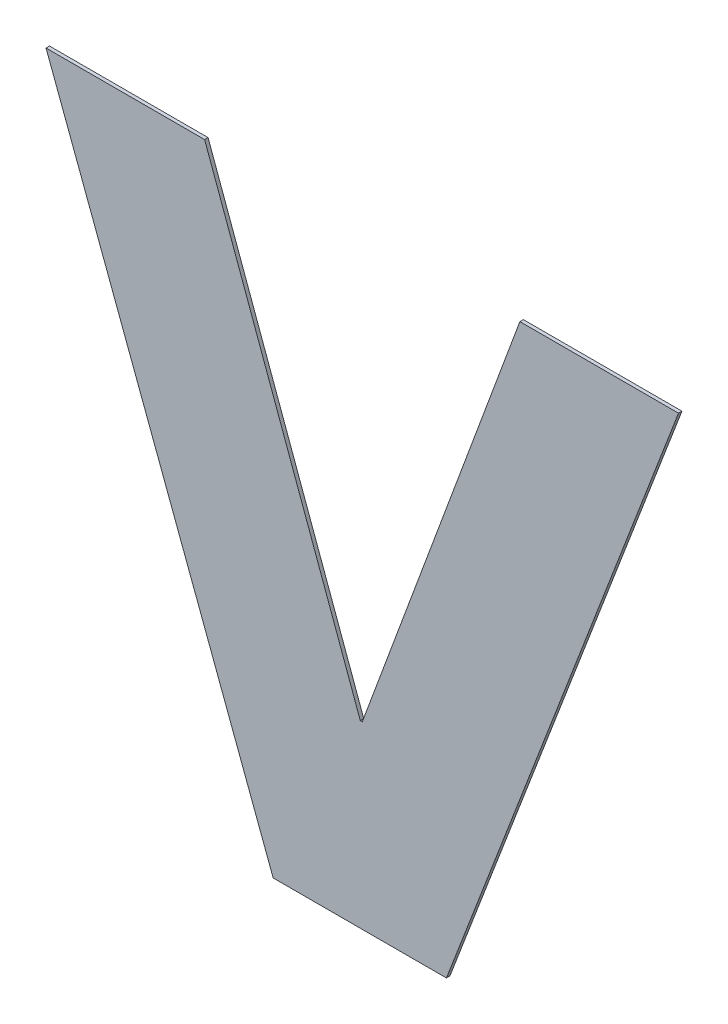
ISO-10303-21;
HEADER;
FILE_DESCRIPTION(('STEP AP214'),'2;1');
FILE_NAME('part.step','',(''),(''),'','','');
FILE_SCHEMA(('AUTOMOTIVE_DESIGN { 1 0 10303 214 1 1 1 1 }'));
ENDSEC;
DATA;
#1=APPLICATION_CONTEXT('core data for automotive mechanical design processes');
#2=APPLICATION_PROTOCOL_DEFINITION('international standard','automotive_design',2000,#1);
#3=PRODUCT_CONTEXT('',#1,'mechanical');
#4=PRODUCT('Part','Part','',(#3));
#5=PRODUCT_RELATED_PRODUCT_CATEGORY('part','',(#4));
#6=PRODUCT_DEFINITION_FORMATION('','',#4);
#7=PRODUCT_DEFINITION_CONTEXT('part definition',#1,'design');
#8=PRODUCT_DEFINITION('design','',#6,#7);
#9=PRODUCT_DEFINITION_SHAPE('','',#8);
#10=(LENGTH_UNIT() NAMED_UNIT(*) SI_UNIT(.MILLI.,.METRE.));
#11=(NAMED_UNIT(*) PLANE_ANGLE_UNIT() SI_UNIT($,.RADIAN.));
#12=(NAMED_UNIT(*) SI_UNIT($,.STERADIAN.) SOLID_ANGLE_UNIT());
#13=UNCERTAINTY_MEASURE_WITH_UNIT(LENGTH_MEASURE(1.E-05),#10,'distance_accuracy_value','');
#14=(GEOMETRIC_REPRESENTATION_CONTEXT(3) GLOBAL_UNCERTAINTY_ASSIGNED_CONTEXT((#13)) GLOBAL_UNIT_ASSIGNED_CONTEXT((#10,
#11,#12)) REPRESENTATION_CONTEXT('',''));
#15=CARTESIAN_POINT('',(0.,0.,0.));
#16=DIRECTION('',(0.,0.,1.));
#17=DIRECTION('',(1.,0.,0.));
#18=AXIS2_PLACEMENT_3D('',#15,#16,#17);
#19=CARTESIAN_POINT('',(-0.220778655224025,0.77328037838195,0.00045));
#20=DIRECTION('',(0.,-1.,0.));
#21=DIRECTION('',(0.,0.,-1.));
#22=AXIS2_PLACEMENT_3D('',#19,#20,#21);
#23=PLANE('',#22);
#24=DIRECTION('',(0.,0.,1.));
#25=VECTOR('',#24,1.);
#26=CARTESIAN_POINT('',(-0.209498829549,0.77328037838195,0.));
#27=LINE('',#26,#25);
#28=CARTESIAN_POINT('',(-0.209498829549,0.77328037838195,0.));
#29=VERTEX_POINT('',#28);
#30=CARTESIAN_POINT('',(-0.209498829549,0.77328037838195,0.00045));
#31=VERTEX_POINT('',#30);
#32=EDGE_CURVE('E11',#29,#31,#27,.T.);
#33=ORIENTED_EDGE('',*,*,#32,.T.);
#34=DIRECTION('',(-1.,0.,0.));
#35=VECTOR('',#34,1.);
#36=CARTESIAN_POINT('',(-0.209498829549,0.77328037838195,0.00045));
#37=LINE('',#36,#35);
#38=CARTESIAN_POINT('',(-0.23205848089905,0.77328037838195,0.00045));
#39=VERTEX_POINT('',#38);
#40=EDGE_CURVE('E143',#31,#39,#37,.T.);
#41=ORIENTED_EDGE('',*,*,#40,.T.);
#42=DIRECTION('',(0.,0.,1.));
#43=VECTOR('',#42,1.);
#44=CARTESIAN_POINT('',(-0.23205848089905,0.77328037838195,0.));
#45=LINE('',#44,#43);
#46=CARTESIAN_POINT('',(-0.23205848089905,0.77328037838195,0.));
#47=VERTEX_POINT('',#46);
#48=EDGE_CURVE('E24',#47,#39,#45,.T.);
#49=ORIENTED_EDGE('',*,*,#48,.F.);
#50=DIRECTION('',(-1.,0.,0.));
#51=VECTOR('',#50,1.);
#52=CARTESIAN_POINT('',(-0.209498829549,0.77328037838195,0.));
#53=LINE('',#52,#51);
#54=EDGE_CURVE('E132',#29,#47,#53,.T.);
#55=ORIENTED_EDGE('',*,*,#54,.F.);
#56=EDGE_LOOP('',(#33,#41,#49,#55));
#57=FACE_BOUND('',#56,.T.);
#58=ADVANCED_FACE('F17',(#57),#23,.T.);
#59=CARTESIAN_POINT('',(-0.246843954249,0.8126754605645,0.00045));
#60=DIRECTION('',(-0.936232902766256,-0.351380067416851,0.));
#61=DIRECTION('',(0.,0.,1.));
#62=AXIS2_PLACEMENT_3D('',#59,#60,#61);
#63=PLANE('',#62);
#64=ORIENTED_EDGE('',*,*,#48,.T.);
#65=DIRECTION('',(-0.351380067416851,0.936232902766256,0.));
#66=VECTOR('',#65,1.);
#67=CARTESIAN_POINT('',(-0.23205848089905,0.77328037838195,0.00045));
#68=LINE('',#67,#66);
#69=CARTESIAN_POINT('',(-0.26162942759895,0.85207054274705,0.00045));
#70=VERTEX_POINT('',#69);
#71=EDGE_CURVE('E139',#39,#70,#68,.T.);
#72=ORIENTED_EDGE('',*,*,#71,.T.);
#73=DIRECTION('',(-1.2335811384724E-13,0.,1.));
#74=VECTOR('',#73,1.);
#75=CARTESIAN_POINT('',(-0.26162942759895,0.85207054274705,0.));
#76=LINE('',#75,#74);
#77=CARTESIAN_POINT('',(-0.26162942759895,0.85207054274705,0.));
#78=VERTEX_POINT('',#77);
#79=EDGE_CURVE('E141',#78,#70,#76,.T.);
#80=ORIENTED_EDGE('',*,*,#79,.F.);
#81=DIRECTION('',(-0.351380067416851,0.936232902766256,0.));
#82=VECTOR('',#81,1.);
#83=CARTESIAN_POINT('',(-0.23205848089905,0.77328037838195,0.));
#84=LINE('',#83,#82);
#85=EDGE_CURVE('E124',#47,#78,#84,.T.);
#86=ORIENTED_EDGE('',*,*,#85,.F.);
#87=EDGE_LOOP('',(#64,#72,#80,#86));
#88=FACE_BOUND('',#87,.T.);
#89=ADVANCED_FACE('F150',(#88),#63,.T.);
#90=CARTESIAN_POINT('',(-0.251306515173975,0.85207054274705,0.00045));
#91=DIRECTION('',(0.,1.,0.));
#92=DIRECTION('',(0.,0.,1.));
#93=AXIS2_PLACEMENT_3D('',#90,#91,#92);
#94=PLANE('',#93);
#95=ORIENTED_EDGE('',*,*,#79,.T.);
#96=DIRECTION('',(1.,0.,0.));
#97=VECTOR('',#96,1.);
#98=CARTESIAN_POINT('',(-0.26162942759895,0.85207054274705,0.00045));
#99=LINE('',#98,#97);
#100=CARTESIAN_POINT('',(-0.240983602749,0.85207054274705,0.00045));
#101=VERTEX_POINT('',#100);
#102=EDGE_CURVE('E134',#70,#101,#99,.T.);
#103=ORIENTED_EDGE('',*,*,#102,.T.);
#104=DIRECTION('',(0.,0.,1.));
#105=VECTOR('',#104,1.);
#106=CARTESIAN_POINT('',(-0.240983602749,0.85207054274705,0.));
#107=LINE('',#106,#105);
#108=CARTESIAN_POINT('',(-0.240983602749,0.85207054274705,0.));
#109=VERTEX_POINT('',#108);
#110=EDGE_CURVE('E137',#109,#101,#107,.T.);
#111=ORIENTED_EDGE('',*,*,#110,.F.);
#112=DIRECTION('',(1.,0.,0.));
#113=VECTOR('',#112,1.);
#114=CARTESIAN_POINT('',(-0.26162942759895,0.85207054274705,0.));
#115=LINE('',#114,#113);
#116=EDGE_CURVE('E116',#78,#109,#115,.T.);
#117=ORIENTED_EDGE('',*,*,#116,.F.);
#118=EDGE_LOOP('',(#95,#103,#111,#117));
#119=FACE_BOUND('',#118,.T.);
#120=ADVANCED_FACE('F153',(#119),#94,.T.);
#121=CARTESIAN_POINT('',(-0.230848621749,0.8243788909295,0.00045));
#122=DIRECTION('',(0.939080291965946,0.343697840029804,0.));
#123=DIRECTION('',(0.,0.,-1.));
#124=AXIS2_PLACEMENT_3D('',#121,#122,#123);
#125=PLANE('',#124);
#126=ORIENTED_EDGE('',*,*,#110,.T.);
#127=DIRECTION('',(0.343697840029803,-0.939080291965947,0.));
#128=VECTOR('',#127,1.);
#129=CARTESIAN_POINT('',(-0.240983602749,0.85207054274705,0.00045));
#130=LINE('',#129,#128);
#131=CARTESIAN_POINT('',(-0.220713640749,0.79668723911195,0.00045));
#132=VERTEX_POINT('',#131);
#133=EDGE_CURVE('E127',#101,#132,#130,.T.);
#134=ORIENTED_EDGE('',*,*,#133,.T.);
#135=DIRECTION('',(0.,0.,1.));
#136=VECTOR('',#135,1.);
#137=CARTESIAN_POINT('',(-0.220713640749,0.79668723911195,0.));
#138=LINE('',#137,#136);
#139=CARTESIAN_POINT('',(-0.220713640749,0.79668723911195,0.));
#140=VERTEX_POINT('',#139);
#141=EDGE_CURVE('E130',#140,#132,#138,.T.);
#142=ORIENTED_EDGE('',*,*,#141,.F.);
#143=DIRECTION('',(0.343697840029803,-0.939080291965947,0.));
#144=VECTOR('',#143,1.);
#145=CARTESIAN_POINT('',(-0.240983602749,0.85207054274705,0.));
#146=LINE('',#145,#144);
#147=EDGE_CURVE('E89',#109,#140,#146,.T.);
#148=ORIENTED_EDGE('',*,*,#147,.F.);
#149=EDGE_LOOP('',(#126,#134,#142,#148));
#150=FACE_BOUND('',#149,.T.);
#151=ADVANCED_FACE('F157',(#150),#125,.T.);
#152=CARTESIAN_POINT('',(-0.220586662974,0.79668723911195,0.00045));
#153=DIRECTION('',(0.,1.,0.));
#154=DIRECTION('',(0.,0.,1.));
#155=AXIS2_PLACEMENT_3D('',#152,#153,#154);
#156=PLANE('',#155);
#157=ORIENTED_EDGE('',*,*,#141,.T.);
#158=DIRECTION('',(1.,0.,0.));
#159=VECTOR('',#158,1.);
#160=CARTESIAN_POINT('',(-0.220713640749,0.79668723911195,0.00045));
#161=LINE('',#160,#159);
#162=CARTESIAN_POINT('',(-0.220459685199,0.79668723911195,0.00045));
#163=VERTEX_POINT('',#162);
#164=EDGE_CURVE('E119',#132,#163,#161,.T.);
#165=ORIENTED_EDGE('',*,*,#164,.T.);
#166=DIRECTION('',(0.,0.,1.));
#167=VECTOR('',#166,1.);
#168=CARTESIAN_POINT('',(-0.220459685199,0.79668723911195,0.));
#169=LINE('',#168,#167);
#170=CARTESIAN_POINT('',(-0.220459685199,0.79668723911195,0.));
#171=VERTEX_POINT('',#170);
#172=EDGE_CURVE('E122',#171,#163,#169,.T.);
#173=ORIENTED_EDGE('',*,*,#172,.F.);
#174=DIRECTION('',(1.,0.,0.));
#175=VECTOR('',#174,1.);
#176=CARTESIAN_POINT('',(-0.220713640749,0.79668723911195,0.));
#177=LINE('',#176,#175);
#178=EDGE_CURVE('E106',#140,#171,#177,.T.);
#179=ORIENTED_EDGE('',*,*,#178,.F.);
#180=EDGE_LOOP('',(#157,#165,#173,#179));
#181=FACE_BOUND('',#180,.T.);
#182=ADVANCED_FACE('F160',(#181),#156,.T.);
#183=CARTESIAN_POINT('',(-0.210198739248975,0.8243788909295,0.00045));
#184=DIRECTION('',(-0.937696048296048,0.34745664623083,0.));
#185=DIRECTION('',(0.,0.,1.));
#186=AXIS2_PLACEMENT_3D('',#183,#184,#185);
#187=PLANE('',#186);
#188=ORIENTED_EDGE('',*,*,#172,.T.);
#189=DIRECTION('',(0.34745664623083,0.937696048296048,0.));
#190=VECTOR('',#189,1.);
#191=CARTESIAN_POINT('',(-0.220459685199,0.79668723911195,0.00045));
#192=LINE('',#191,#190);
#193=CARTESIAN_POINT('',(-0.19993779329895,0.85207054274705,0.00045));
#194=VERTEX_POINT('',#193);
#195=EDGE_CURVE('E111',#163,#194,#192,.T.);
#196=ORIENTED_EDGE('',*,*,#195,.T.);
#197=DIRECTION('',(0.,0.,1.));
#198=VECTOR('',#197,1.);
#199=CARTESIAN_POINT('',(-0.19993779329895,0.85207054274705,0.));
#200=LINE('',#199,#198);
#201=CARTESIAN_POINT('',(-0.19993779329895,0.85207054274705,0.));
#202=VERTEX_POINT('',#201);
#203=EDGE_CURVE('E114',#202,#194,#200,.T.);
#204=ORIENTED_EDGE('',*,*,#203,.F.);
#205=DIRECTION('',(0.34745664623083,0.937696048296048,0.));
#206=VECTOR('',#205,1.);
#207=CARTESIAN_POINT('',(-0.220459685199,0.79668723911195,0.));
#208=LINE('',#207,#206);
#209=EDGE_CURVE('E100',#171,#202,#208,.T.);
#210=ORIENTED_EDGE('',*,*,#209,.F.);
#211=EDGE_LOOP('',(#188,#196,#204,#210));
#212=FACE_BOUND('',#211,.T.);
#213=ADVANCED_FACE('F163',(#212),#187,.T.);
#214=CARTESIAN_POINT('',(-0.189611832873975,0.85207054274705,0.00045));
#215=DIRECTION('',(0.,1.,0.));
#216=DIRECTION('',(0.,0.,1.));
#217=AXIS2_PLACEMENT_3D('',#214,#215,#216);
#218=PLANE('',#217);
#219=ORIENTED_EDGE('',*,*,#203,.T.);
#220=DIRECTION('',(1.,0.,0.));
#221=VECTOR('',#220,1.);
#222=CARTESIAN_POINT('',(-0.19993779329895,0.85207054274705,0.00045));
#223=LINE('',#222,#221);
#224=CARTESIAN_POINT('',(-0.179285872449,0.85207054274705,0.00045));
#225=VERTEX_POINT('',#224);
#226=EDGE_CURVE('E86',#194,#225,#223,.T.);
#227=ORIENTED_EDGE('',*,*,#226,.T.);
#228=DIRECTION('',(0.,0.,1.));
#229=VECTOR('',#228,1.);
#230=CARTESIAN_POINT('',(-0.179285872449,0.85207054274705,0.));
#231=LINE('',#230,#229);
#232=CARTESIAN_POINT('',(-0.179285872449,0.85207054274705,0.));
#233=VERTEX_POINT('',#232);
#234=EDGE_CURVE('E79',#233,#225,#231,.T.);
#235=ORIENTED_EDGE('',*,*,#234,.F.);
#236=DIRECTION('',(1.,0.,0.));
#237=VECTOR('',#236,1.);
#238=CARTESIAN_POINT('',(-0.19993779329895,0.85207054274705,0.));
#239=LINE('',#238,#237);
#240=EDGE_CURVE('E83',#202,#233,#239,.T.);
#241=ORIENTED_EDGE('',*,*,#240,.F.);
#242=EDGE_LOOP('',(#219,#227,#235,#241));
#243=FACE_BOUND('',#242,.T.);
#244=ADVANCED_FACE('F81',(#243),#218,.T.);
#245=CARTESIAN_POINT('',(-0.194392350999,0.8126754605645,0.00045));
#246=DIRECTION('',(0.933706263815722,-0.358039959936437,0.));
#247=DIRECTION('',(0.,0.,-1.));
#248=AXIS2_PLACEMENT_3D('',#245,#246,#247);
#249=PLANE('',#248);
#250=ORIENTED_EDGE('',*,*,#234,.T.);
#251=DIRECTION('',(-0.358039959936437,-0.933706263815722,0.));
#252=VECTOR('',#251,1.);
#253=CARTESIAN_POINT('',(-0.179285872449,0.85207054274705,0.00045));
#254=LINE('',#253,#252);
#255=EDGE_CURVE('E102',#225,#31,#254,.T.);
#256=ORIENTED_EDGE('',*,*,#255,.T.);
#257=ORIENTED_EDGE('',*,*,#32,.F.);
#258=DIRECTION('',(-0.358039959936437,-0.933706263815722,0.));
#259=VECTOR('',#258,1.);
#260=CARTESIAN_POINT('',(-0.179285872449,0.85207054274705,0.));
#261=LINE('',#260,#259);
#262=EDGE_CURVE('E92',#233,#29,#261,.T.);
#263=ORIENTED_EDGE('',*,*,#262,.F.);
#264=EDGE_LOOP('',(#250,#256,#257,#263));
#265=FACE_BOUND('',#264,.T.);
#266=ADVANCED_FACE('F93',(#265),#249,.T.);
#267=CARTESIAN_POINT('',(-0.220457650023975,0.77328037838195,0.));
#268=DIRECTION('',(0.,0.,1.));
#269=DIRECTION('',(1.,0.,0.));
#270=AXIS2_PLACEMENT_3D('',#267,#268,#269);
#271=PLANE('',#270);
#272=ORIENTED_EDGE('',*,*,#54,.T.);
#273=ORIENTED_EDGE('',*,*,#85,.T.);
#274=ORIENTED_EDGE('',*,*,#116,.T.);
#275=ORIENTED_EDGE('',*,*,#147,.T.);
#276=ORIENTED_EDGE('',*,*,#178,.T.);
#277=ORIENTED_EDGE('',*,*,#209,.T.);
#278=ORIENTED_EDGE('',*,*,#240,.T.);
#279=ORIENTED_EDGE('',*,*,#262,.T.);
#280=EDGE_LOOP('',(#272,#273,#274,#275,#276,#277,#278,#279));
#281=FACE_BOUND('',#280,.T.);
#282=ADVANCED_FACE('F97',(#281),#271,.F.);
#283=CARTESIAN_POINT('',(-0.220457650023975,0.77328037838195,0.00045));
#284=DIRECTION('',(0.,0.,1.));
#285=DIRECTION('',(1.,0.,0.));
#286=AXIS2_PLACEMENT_3D('',#283,#284,#285);
#287=PLANE('',#286);
#288=ORIENTED_EDGE('',*,*,#40,.F.);
#289=ORIENTED_EDGE('',*,*,#255,.F.);
#290=ORIENTED_EDGE('',*,*,#226,.F.);
#291=ORIENTED_EDGE('',*,*,#195,.F.);
#292=ORIENTED_EDGE('',*,*,#164,.F.);
#293=ORIENTED_EDGE('',*,*,#133,.F.);
#294=ORIENTED_EDGE('',*,*,#102,.F.);
#295=ORIENTED_EDGE('',*,*,#71,.F.);
#296=EDGE_LOOP('',(#288,#289,#290,#291,#292,#293,#294,#295));
#297=FACE_BOUND('',#296,.T.);
#298=ADVANCED_FACE('F148',(#297),#287,.T.);
#299=CLOSED_SHELL('',(#58,#89,#120,#151,#182,#213,#244,#266,#282,#298));
#300=MANIFOLD_SOLID_BREP('B1',#299);
#301=ADVANCED_BREP_SHAPE_REPRESENTATION('',(#18,#300),#14);
#302=SHAPE_DEFINITION_REPRESENTATION(#9,#301);
ENDSEC;
END-ISO-10303-21;
